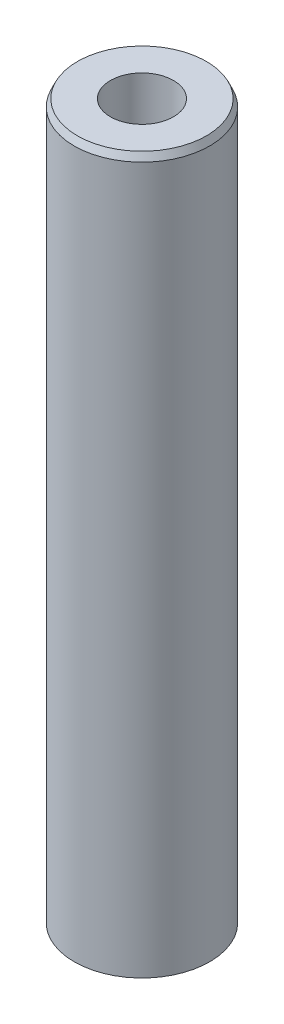
ISO-10303-21;
HEADER;
FILE_DESCRIPTION(('STEP AP214'),'2;1');
FILE_NAME('part.step','',(''),(''),'','','');
FILE_SCHEMA(('AUTOMOTIVE_DESIGN { 1 0 10303 214 1 1 1 1 }'));
ENDSEC;
DATA;
#1=APPLICATION_CONTEXT('core data for automotive mechanical design processes');
#2=APPLICATION_PROTOCOL_DEFINITION('international standard','automotive_design',2000,#1);
#3=PRODUCT_CONTEXT('',#1,'mechanical');
#4=PRODUCT('Part','Part','',(#3));
#5=PRODUCT_RELATED_PRODUCT_CATEGORY('part','',(#4));
#6=PRODUCT_DEFINITION_FORMATION('','',#4);
#7=PRODUCT_DEFINITION_CONTEXT('part definition',#1,'design');
#8=PRODUCT_DEFINITION('design','',#6,#7);
#9=PRODUCT_DEFINITION_SHAPE('','',#8);
#10=(LENGTH_UNIT() NAMED_UNIT(*) SI_UNIT(.MILLI.,.METRE.));
#11=(NAMED_UNIT(*) PLANE_ANGLE_UNIT() SI_UNIT($,.RADIAN.));
#12=(NAMED_UNIT(*) SI_UNIT($,.STERADIAN.) SOLID_ANGLE_UNIT());
#13=UNCERTAINTY_MEASURE_WITH_UNIT(LENGTH_MEASURE(1.E-05),#10,'distance_accuracy_value','');
#14=(GEOMETRIC_REPRESENTATION_CONTEXT(3) GLOBAL_UNCERTAINTY_ASSIGNED_CONTEXT((#13)) GLOBAL_UNIT_ASSIGNED_CONTEXT((#10,
#11,#12)) REPRESENTATION_CONTEXT('',''));
#15=CARTESIAN_POINT('',(0.,0.,0.));
#16=DIRECTION('',(0.,0.,1.));
#17=DIRECTION('',(1.,0.,0.));
#18=AXIS2_PLACEMENT_3D('',#15,#16,#17);
#19=CARTESIAN_POINT('',(0.,529.287193730248,0.));
#20=DIRECTION('',(0.,-1.,0.));
#21=DIRECTION('',(0.,0.,-1.));
#22=AXIS2_PLACEMENT_3D('',#19,#20,#21);
#23=CYLINDRICAL_SURFACE('',#22,50.);
#24=CARTESIAN_POINT('',(0.,524.004071003264,0.));
#25=DIRECTION('',(0.,1.,0.));
#26=DIRECTION('',(0.,0.,1.));
#27=AXIS2_PLACEMENT_3D('',#24,#25,#26);
#28=CIRCLE('',#27,50.);
#29=CARTESIAN_POINT('',(0.,524.004071003264,50.));
#30=VERTEX_POINT('',#29);
#31=EDGE_CURVE('E50',#30,#30,#28,.F.);
#32=ORIENTED_EDGE('',*,*,#31,.T.);
#33=EDGE_LOOP('',(#32));
#34=FACE_BOUND('',#33,.T.);
#35=CARTESIAN_POINT('',(0.,2.40138795592315,0.));
#36=DIRECTION('',(0.,1.,0.));
#37=DIRECTION('',(0.,0.,1.));
#38=AXIS2_PLACEMENT_3D('',#35,#36,#37);
#39=CIRCLE('',#38,50.);
#40=CARTESIAN_POINT('',(0.,2.40138795592315,50.));
#41=VERTEX_POINT('',#40);
#42=EDGE_CURVE('E51',#41,#41,#39,.T.);
#43=ORIENTED_EDGE('',*,*,#42,.T.);
#44=EDGE_LOOP('',(#43));
#45=FACE_BOUND('',#44,.T.);
#46=ADVANCED_FACE('F39',(#34,#45),#23,.T.);
#47=CARTESIAN_POINT('',(0.,529.287193730248,0.));
#48=DIRECTION('',(0.,1.,0.));
#49=DIRECTION('',(0.,0.,1.));
#50=AXIS2_PLACEMENT_3D('',#47,#48,#49);
#51=PLANE('',#50);
#52=CARTESIAN_POINT('',(0.,529.287193730248,0.));
#53=DIRECTION('',(0.,1.,0.));
#54=DIRECTION('',(0.,0.,1.));
#55=AXIS2_PLACEMENT_3D('',#52,#53,#54);
#56=CIRCLE('',#55,47.5986120440771);
#57=CARTESIAN_POINT('',(0.,529.287193730248,47.5986120440771));
#58=VERTEX_POINT('',#57);
#59=EDGE_CURVE('E54',#58,#58,#56,.T.);
#60=ORIENTED_EDGE('',*,*,#59,.T.);
#61=EDGE_LOOP('',(#60));
#62=FACE_BOUND('',#61,.T.);
#63=CARTESIAN_POINT('',(0.,529.287193730248,0.));
#64=DIRECTION('',(0.,1.,0.));
#65=DIRECTION('',(0.,0.,1.));
#66=AXIS2_PLACEMENT_3D('',#63,#64,#65);
#67=CIRCLE('',#66,23.2697913552618);
#68=CARTESIAN_POINT('',(0.,529.287193730248,23.2697913552618));
#69=VERTEX_POINT('',#68);
#70=EDGE_CURVE('E58',#69,#69,#67,.T.);
#71=ORIENTED_EDGE('',*,*,#70,.F.);
#72=EDGE_LOOP('',(#71));
#73=FACE_BOUND('',#72,.T.);
#74=ADVANCED_FACE('F69',(#62,#73),#51,.T.);
#75=CARTESIAN_POINT('',(0.,0.,0.));
#76=DIRECTION('',(0.,1.,0.));
#77=DIRECTION('',(0.,0.,1.));
#78=AXIS2_PLACEMENT_3D('',#75,#76,#77);
#79=PLANE('',#78);
#80=CARTESIAN_POINT('',(0.,0.,0.));
#81=DIRECTION('',(0.,1.,0.));
#82=DIRECTION('',(0.,0.,1.));
#83=AXIS2_PLACEMENT_3D('',#80,#81,#82);
#84=CIRCLE('',#83,44.716877273015);
#85=CARTESIAN_POINT('',(0.,0.,44.716877273015));
#86=VERTEX_POINT('',#85);
#87=EDGE_CURVE('E10',#86,#86,#84,.F.);
#88=ORIENTED_EDGE('',*,*,#87,.T.);
#89=EDGE_LOOP('',(#88));
#90=FACE_BOUND('',#89,.T.);
#91=CARTESIAN_POINT('',(0.,0.,0.));
#92=DIRECTION('',(0.,1.,0.));
#93=DIRECTION('',(0.,0.,1.));
#94=AXIS2_PLACEMENT_3D('',#91,#92,#93);
#95=CIRCLE('',#94,23.2697913552618);
#96=CARTESIAN_POINT('',(0.,0.,23.2697913552618));
#97=VERTEX_POINT('',#96);
#98=EDGE_CURVE('E63',#97,#97,#95,.T.);
#99=ORIENTED_EDGE('',*,*,#98,.T.);
#100=EDGE_LOOP('',(#99));
#101=FACE_BOUND('',#100,.T.);
#102=ADVANCED_FACE('F75',(#90,#101),#79,.F.);
#103=CARTESIAN_POINT('',(0.,529.287193730248,0.));
#104=DIRECTION('',(0.,-1.,0.));
#105=DIRECTION('',(0.,0.,-1.));
#106=AXIS2_PLACEMENT_3D('',#103,#104,#105);
#107=CYLINDRICAL_SURFACE('',#106,23.2697913552618);
#108=ORIENTED_EDGE('',*,*,#70,.T.);
#109=EDGE_LOOP('',(#108));
#110=FACE_BOUND('',#109,.T.);
#111=ORIENTED_EDGE('',*,*,#98,.F.);
#112=EDGE_LOOP('',(#111));
#113=FACE_BOUND('',#112,.T.);
#114=ADVANCED_FACE('F70',(#110,#113),#107,.F.);
#115=CARTESIAN_POINT('',(0.,529.287193730248,0.));
#116=DIRECTION('',(0.,-1.,0.));
#117=DIRECTION('',(0.,0.,-1.));
#118=AXIS2_PLACEMENT_3D('',#115,#116,#117);
#119=CONICAL_SURFACE('',#118,47.5986120440771,0.426622557111436);
#120=ORIENTED_EDGE('',*,*,#31,.F.);
#121=EDGE_LOOP('',(#120));
#122=FACE_BOUND('',#121,.T.);
#123=ORIENTED_EDGE('',*,*,#59,.F.);
#124=EDGE_LOOP('',(#123));
#125=FACE_BOUND('',#124,.T.);
#126=ADVANCED_FACE('F81',(#122,#125),#119,.T.);
#127=CARTESIAN_POINT('',(0.,2.40138795592315,0.));
#128=DIRECTION('',(0.,1.,0.));
#129=DIRECTION('',(0.,0.,1.));
#130=AXIS2_PLACEMENT_3D('',#127,#128,#129);
#131=CONICAL_SURFACE('',#130,50.,1.14417376968348);
#132=ORIENTED_EDGE('',*,*,#87,.F.);
#133=EDGE_LOOP('',(#132));
#134=FACE_BOUND('',#133,.T.);
#135=ORIENTED_EDGE('',*,*,#42,.F.);
#136=EDGE_LOOP('',(#135));
#137=FACE_BOUND('',#136,.T.);
#138=ADVANCED_FACE('F45',(#134,#137),#131,.T.);
#139=CLOSED_SHELL('',(#46,#74,#102,#114,#126,#138));
#140=MANIFOLD_SOLID_BREP('B2',#139);
#141=ADVANCED_BREP_SHAPE_REPRESENTATION('',(#18,#140),#14);
#142=SHAPE_DEFINITION_REPRESENTATION(#9,#141);
ENDSEC;
END-ISO-10303-21;
